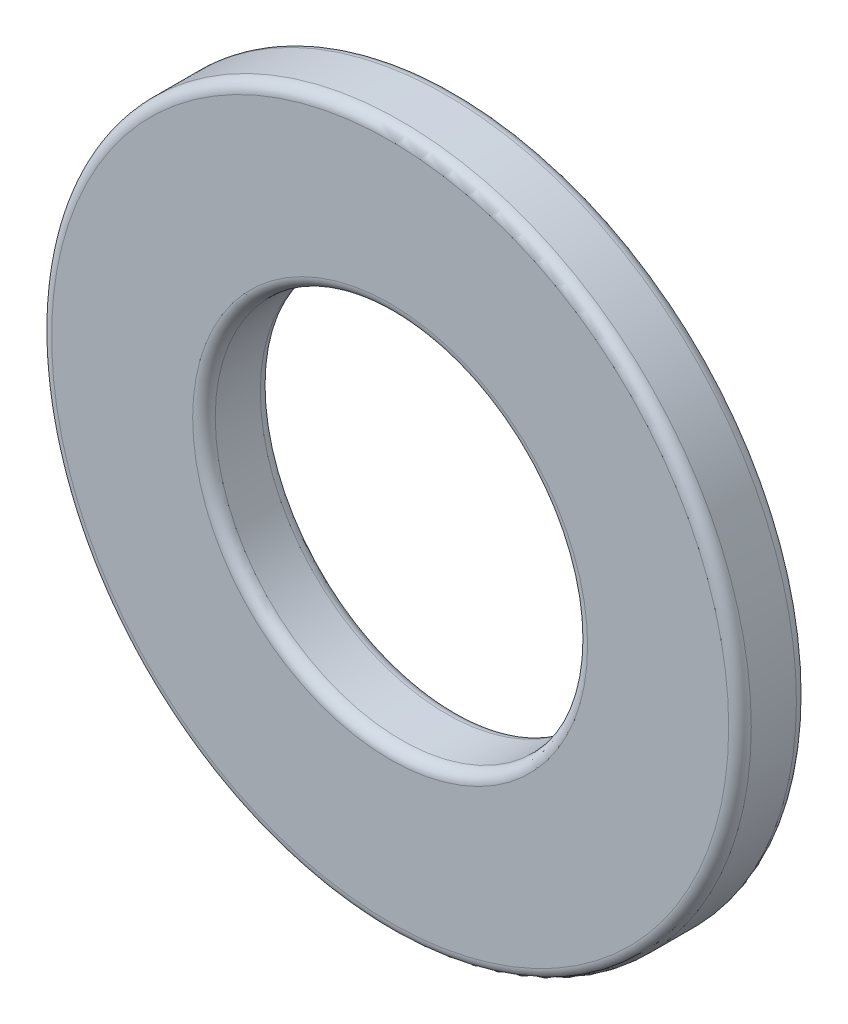
ISO-10303-21;
HEADER;
FILE_DESCRIPTION(('STEP AP214'),'2;1');
FILE_NAME('part.step','',(''),(''),'','','');
FILE_SCHEMA(('AUTOMOTIVE_DESIGN { 1 0 10303 214 1 1 1 1 }'));
ENDSEC;
DATA;
#1=APPLICATION_CONTEXT('core data for automotive mechanical design processes');
#2=APPLICATION_PROTOCOL_DEFINITION('international standard','automotive_design',2000,#1);
#3=PRODUCT_CONTEXT('',#1,'mechanical');
#4=PRODUCT('Part','Part','',(#3));
#5=PRODUCT_RELATED_PRODUCT_CATEGORY('part','',(#4));
#6=PRODUCT_DEFINITION_FORMATION('','',#4);
#7=PRODUCT_DEFINITION_CONTEXT('part definition',#1,'design');
#8=PRODUCT_DEFINITION('design','',#6,#7);
#9=PRODUCT_DEFINITION_SHAPE('','',#8);
#10=(LENGTH_UNIT() NAMED_UNIT(*) SI_UNIT(.MILLI.,.METRE.));
#11=(NAMED_UNIT(*) PLANE_ANGLE_UNIT() SI_UNIT($,.RADIAN.));
#12=(NAMED_UNIT(*) SI_UNIT($,.STERADIAN.) SOLID_ANGLE_UNIT());
#13=UNCERTAINTY_MEASURE_WITH_UNIT(LENGTH_MEASURE(1.E-05),#10,'distance_accuracy_value','');
#14=(GEOMETRIC_REPRESENTATION_CONTEXT(3) GLOBAL_UNCERTAINTY_ASSIGNED_CONTEXT((#13)) GLOBAL_UNIT_ASSIGNED_CONTEXT((#10,
#11,#12)) REPRESENTATION_CONTEXT('',''));
#15=CARTESIAN_POINT('',(0.,0.,0.));
#16=DIRECTION('',(0.,0.,1.));
#17=DIRECTION('',(1.,0.,0.));
#18=AXIS2_PLACEMENT_3D('',#15,#16,#17);
#19=CARTESIAN_POINT('',(0.,0.,1.5));
#20=DIRECTION('',(0.,0.,1.));
#21=DIRECTION('',(1.,0.,0.));
#22=AXIS2_PLACEMENT_3D('',#19,#20,#21);
#23=PLANE('',#22);
#24=CARTESIAN_POINT('',(0.,0.,1.5));
#25=DIRECTION('',(0.,0.,1.));
#26=DIRECTION('',(1.,0.,0.));
#27=AXIS2_PLACEMENT_3D('',#24,#25,#26);
#28=CIRCLE('',#27,4.375);
#29=CARTESIAN_POINT('',(4.375,0.,1.5));
#30=VERTEX_POINT('',#29);
#31=EDGE_CURVE('E10',#30,#30,#28,.F.);
#32=ORIENTED_EDGE('',*,*,#31,.T.);
#33=EDGE_LOOP('',(#32));
#34=FACE_BOUND('',#33,.T.);
#35=CARTESIAN_POINT('',(0.,0.,1.5));
#36=DIRECTION('',(0.,0.,1.));
#37=DIRECTION('',(1.,0.,0.));
#38=AXIS2_PLACEMENT_3D('',#35,#36,#37);
#39=CIRCLE('',#38,7.5);
#40=CARTESIAN_POINT('',(7.5,0.,1.5));
#41=VERTEX_POINT('',#40);
#42=EDGE_CURVE('E45',#41,#41,#39,.T.);
#43=ORIENTED_EDGE('',*,*,#42,.T.);
#44=EDGE_LOOP('',(#43));
#45=FACE_BOUND('',#44,.T.);
#46=ADVANCED_FACE('F37',(#34,#45),#23,.T.);
#47=CARTESIAN_POINT('',(0.,0.,0.));
#48=DIRECTION('',(0.,0.,1.));
#49=DIRECTION('',(1.,0.,0.));
#50=AXIS2_PLACEMENT_3D('',#47,#48,#49);
#51=PLANE('',#50);
#52=CARTESIAN_POINT('',(0.,0.,0.));
#53=DIRECTION('',(0.,0.,1.));
#54=DIRECTION('',(1.,0.,0.));
#55=AXIS2_PLACEMENT_3D('',#52,#53,#54);
#56=CIRCLE('',#55,4.375);
#57=CARTESIAN_POINT('',(4.375,0.,0.));
#58=VERTEX_POINT('',#57);
#59=EDGE_CURVE('E69',#58,#58,#56,.T.);
#60=ORIENTED_EDGE('',*,*,#59,.T.);
#61=EDGE_LOOP('',(#60));
#62=FACE_BOUND('',#61,.T.);
#63=CARTESIAN_POINT('',(0.,0.,0.));
#64=DIRECTION('',(0.,0.,1.));
#65=DIRECTION('',(1.,0.,0.));
#66=AXIS2_PLACEMENT_3D('',#63,#64,#65);
#67=CIRCLE('',#66,7.5);
#68=CARTESIAN_POINT('',(7.5,0.,0.));
#69=VERTEX_POINT('',#68);
#70=EDGE_CURVE('E73',#69,#69,#67,.F.);
#71=ORIENTED_EDGE('',*,*,#70,.T.);
#72=EDGE_LOOP('',(#71));
#73=FACE_BOUND('',#72,.T.);
#74=ADVANCED_FACE('F78',(#62,#73),#51,.F.);
#75=CARTESIAN_POINT('',(0.,0.,1.5));
#76=DIRECTION('',(0.,0.,-1.));
#77=DIRECTION('',(-1.,0.,0.));
#78=AXIS2_PLACEMENT_3D('',#75,#76,#77);
#79=CYLINDRICAL_SURFACE('',#78,7.75);
#80=CARTESIAN_POINT('',(0.,0.,0.25));
#81=DIRECTION('',(0.,0.,1.));
#82=DIRECTION('',(1.,0.,0.));
#83=AXIS2_PLACEMENT_3D('',#80,#81,#82);
#84=CIRCLE('',#83,7.75);
#85=CARTESIAN_POINT('',(7.75,0.,0.25));
#86=VERTEX_POINT('',#85);
#87=EDGE_CURVE('E50',#86,#86,#84,.T.);
#88=ORIENTED_EDGE('',*,*,#87,.T.);
#89=EDGE_LOOP('',(#88));
#90=FACE_BOUND('',#89,.T.);
#91=CARTESIAN_POINT('',(0.,0.,1.25));
#92=DIRECTION('',(0.,0.,1.));
#93=DIRECTION('',(1.,0.,0.));
#94=AXIS2_PLACEMENT_3D('',#91,#92,#93);
#95=CIRCLE('',#94,7.75);
#96=CARTESIAN_POINT('',(7.75,0.,1.25));
#97=VERTEX_POINT('',#96);
#98=EDGE_CURVE('E55',#97,#97,#95,.F.);
#99=ORIENTED_EDGE('',*,*,#98,.T.);
#100=EDGE_LOOP('',(#99));
#101=FACE_BOUND('',#100,.T.);
#102=ADVANCED_FACE('F88',(#90,#101),#79,.T.);
#103=CARTESIAN_POINT('',(0.,0.,1.5));
#104=DIRECTION('',(0.,0.,-1.));
#105=DIRECTION('',(-1.,0.,0.));
#106=AXIS2_PLACEMENT_3D('',#103,#104,#105);
#107=CYLINDRICAL_SURFACE('',#106,4.125);
#108=CARTESIAN_POINT('',(0.,0.,0.25));
#109=DIRECTION('',(0.,0.,1.));
#110=DIRECTION('',(1.,0.,0.));
#111=AXIS2_PLACEMENT_3D('',#108,#109,#110);
#112=CIRCLE('',#111,4.125);
#113=CARTESIAN_POINT('',(4.125,0.,0.25));
#114=VERTEX_POINT('',#113);
#115=EDGE_CURVE('E61',#114,#114,#112,.F.);
#116=ORIENTED_EDGE('',*,*,#115,.T.);
#117=EDGE_LOOP('',(#116));
#118=FACE_BOUND('',#117,.T.);
#119=CARTESIAN_POINT('',(0.,0.,1.25));
#120=DIRECTION('',(0.,0.,1.));
#121=DIRECTION('',(1.,0.,0.));
#122=AXIS2_PLACEMENT_3D('',#119,#120,#121);
#123=CIRCLE('',#122,4.125);
#124=CARTESIAN_POINT('',(4.125,0.,1.25));
#125=VERTEX_POINT('',#124);
#126=EDGE_CURVE('E65',#125,#125,#123,.T.);
#127=ORIENTED_EDGE('',*,*,#126,.T.);
#128=EDGE_LOOP('',(#127));
#129=FACE_BOUND('',#128,.T.);
#130=ADVANCED_FACE('F91',(#118,#129),#107,.F.);
#131=CARTESIAN_POINT('',(0.,0.,0.25));
#132=DIRECTION('',(0.,0.,1.));
#133=DIRECTION('',(1.,0.,0.));
#134=AXIS2_PLACEMENT_3D('',#131,#132,#133);
#135=TOROIDAL_SURFACE('',#134,4.375,0.25);
#136=ORIENTED_EDGE('',*,*,#115,.F.);
#137=EDGE_LOOP('',(#136));
#138=FACE_BOUND('',#137,.T.);
#139=ORIENTED_EDGE('',*,*,#59,.F.);
#140=EDGE_LOOP('',(#139));
#141=FACE_BOUND('',#140,.T.);
#142=ADVANCED_FACE('F84',(#138,#141),#135,.T.);
#143=CARTESIAN_POINT('',(0.,0.,0.25));
#144=DIRECTION('',(0.,0.,1.));
#145=DIRECTION('',(1.,0.,0.));
#146=AXIS2_PLACEMENT_3D('',#143,#144,#145);
#147=TOROIDAL_SURFACE('',#146,7.5,0.25);
#148=ORIENTED_EDGE('',*,*,#70,.F.);
#149=EDGE_LOOP('',(#148));
#150=FACE_BOUND('',#149,.T.);
#151=ORIENTED_EDGE('',*,*,#87,.F.);
#152=EDGE_LOOP('',(#151));
#153=FACE_BOUND('',#152,.T.);
#154=ADVANCED_FACE('F80',(#150,#153),#147,.T.);
#155=CARTESIAN_POINT('',(0.,0.,1.25));
#156=DIRECTION('',(0.,0.,1.));
#157=DIRECTION('',(1.,0.,0.));
#158=AXIS2_PLACEMENT_3D('',#155,#156,#157);
#159=TOROIDAL_SURFACE('',#158,4.375,0.25);
#160=ORIENTED_EDGE('',*,*,#31,.F.);
#161=EDGE_LOOP('',(#160));
#162=FACE_BOUND('',#161,.T.);
#163=ORIENTED_EDGE('',*,*,#126,.F.);
#164=EDGE_LOOP('',(#163));
#165=FACE_BOUND('',#164,.T.);
#166=ADVANCED_FACE('F83',(#162,#165),#159,.T.);
#167=CARTESIAN_POINT('',(0.,0.,1.25));
#168=DIRECTION('',(0.,0.,1.));
#169=DIRECTION('',(1.,0.,0.));
#170=AXIS2_PLACEMENT_3D('',#167,#168,#169);
#171=TOROIDAL_SURFACE('',#170,7.5,0.25);
#172=ORIENTED_EDGE('',*,*,#98,.F.);
#173=EDGE_LOOP('',(#172));
#174=FACE_BOUND('',#173,.T.);
#175=ORIENTED_EDGE('',*,*,#42,.F.);
#176=EDGE_LOOP('',(#175));
#177=FACE_BOUND('',#176,.T.);
#178=ADVANCED_FACE('F39',(#174,#177),#171,.T.);
#179=CLOSED_SHELL('',(#46,#74,#102,#130,#142,#154,#166,#178));
#180=MANIFOLD_SOLID_BREP('B2',#179);
#181=ADVANCED_BREP_SHAPE_REPRESENTATION('',(#18,#180),#14);
#182=SHAPE_DEFINITION_REPRESENTATION(#9,#181);
ENDSEC;
END-ISO-10303-21;
